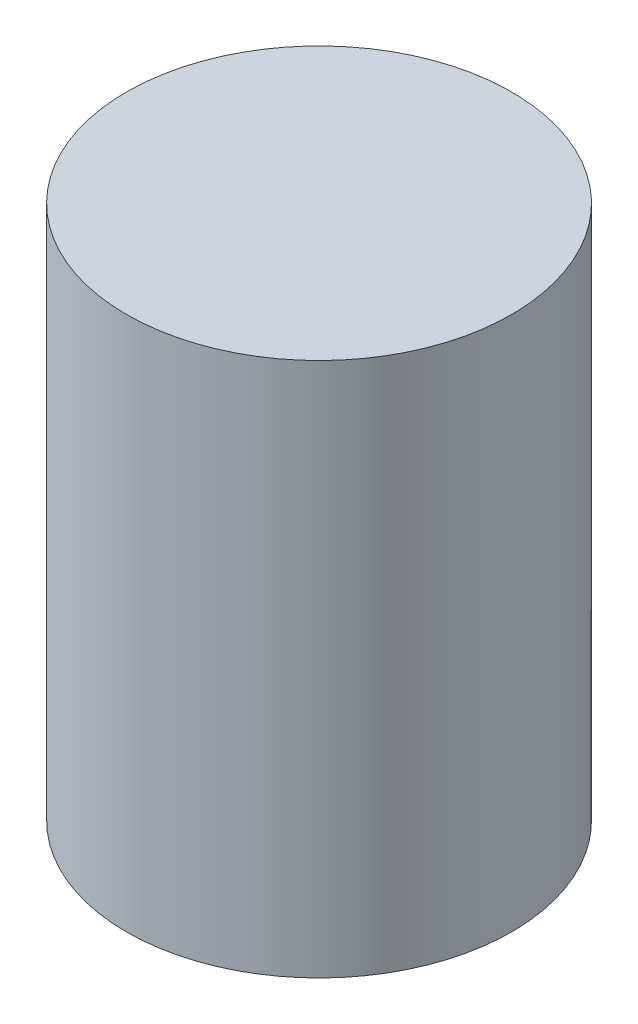
ISO-10303-21;
HEADER;
FILE_DESCRIPTION(('STEP AP214'),'2;1');
FILE_NAME('part.step','',(''),(''),'','','');
FILE_SCHEMA(('AUTOMOTIVE_DESIGN { 1 0 10303 214 1 1 1 1 }'));
ENDSEC;
DATA;
#1=APPLICATION_CONTEXT('core data for automotive mechanical design processes');
#2=APPLICATION_PROTOCOL_DEFINITION('international standard','automotive_design',2000,#1);
#3=PRODUCT_CONTEXT('',#1,'mechanical');
#4=PRODUCT('Part','Part','',(#3));
#5=PRODUCT_RELATED_PRODUCT_CATEGORY('part','',(#4));
#6=PRODUCT_DEFINITION_FORMATION('','',#4);
#7=PRODUCT_DEFINITION_CONTEXT('part definition',#1,'design');
#8=PRODUCT_DEFINITION('design','',#6,#7);
#9=PRODUCT_DEFINITION_SHAPE('','',#8);
#10=(LENGTH_UNIT() NAMED_UNIT(*) SI_UNIT(.MILLI.,.METRE.));
#11=(NAMED_UNIT(*) PLANE_ANGLE_UNIT() SI_UNIT($,.RADIAN.));
#12=(NAMED_UNIT(*) SI_UNIT($,.STERADIAN.) SOLID_ANGLE_UNIT());
#13=UNCERTAINTY_MEASURE_WITH_UNIT(LENGTH_MEASURE(1.E-05),#10,'distance_accuracy_value','');
#14=(GEOMETRIC_REPRESENTATION_CONTEXT(3) GLOBAL_UNCERTAINTY_ASSIGNED_CONTEXT((#13)) GLOBAL_UNIT_ASSIGNED_CONTEXT((#10,
#11,#12)) REPRESENTATION_CONTEXT('',''));
#15=CARTESIAN_POINT('',(0.,0.,0.));
#16=DIRECTION('',(0.,0.,1.));
#17=DIRECTION('',(1.,0.,0.));
#18=AXIS2_PLACEMENT_3D('',#15,#16,#17);
#19=CARTESIAN_POINT('',(0.,13.49375,0.));
#20=DIRECTION('',(0.,-1.,0.));
#21=DIRECTION('',(0.,0.,-1.));
#22=AXIS2_PLACEMENT_3D('',#19,#20,#21);
#23=CYLINDRICAL_SURFACE('',#22,9.723);
#24=CARTESIAN_POINT('',(0.,13.49375,0.));
#25=DIRECTION('',(0.,1.,0.));
#26=DIRECTION('',(0.,0.,1.));
#27=AXIS2_PLACEMENT_3D('',#24,#25,#26);
#28=CIRCLE('',#27,9.723);
#29=CARTESIAN_POINT('',(0.,13.49375,9.723));
#30=VERTEX_POINT('',#29);
#31=EDGE_CURVE('E10',#30,#30,#28,.T.);
#32=ORIENTED_EDGE('',*,*,#31,.F.);
#33=EDGE_LOOP('',(#32));
#34=FACE_BOUND('',#33,.T.);
#35=CARTESIAN_POINT('',(0.,-13.49375,0.));
#36=DIRECTION('',(0.,1.,0.));
#37=DIRECTION('',(0.,0.,1.));
#38=AXIS2_PLACEMENT_3D('',#35,#36,#37);
#39=CIRCLE('',#38,9.723);
#40=CARTESIAN_POINT('',(0.,-13.49375,9.723));
#41=VERTEX_POINT('',#40);
#42=EDGE_CURVE('E40',#41,#41,#39,.T.);
#43=ORIENTED_EDGE('',*,*,#42,.T.);
#44=EDGE_LOOP('',(#43));
#45=FACE_BOUND('',#44,.T.);
#46=ADVANCED_FACE('F37',(#34,#45),#23,.T.);
#47=CARTESIAN_POINT('',(0.,13.49375,0.));
#48=DIRECTION('',(0.,1.,0.));
#49=DIRECTION('',(0.,0.,1.));
#50=AXIS2_PLACEMENT_3D('',#47,#48,#49);
#51=PLANE('',#50);
#52=ORIENTED_EDGE('',*,*,#31,.T.);
#53=EDGE_LOOP('',(#52));
#54=FACE_BOUND('',#53,.T.);
#55=ADVANCED_FACE('F54',(#54),#51,.T.);
#56=CARTESIAN_POINT('',(0.,-13.49375,0.));
#57=DIRECTION('',(0.,1.,0.));
#58=DIRECTION('',(0.,0.,1.));
#59=AXIS2_PLACEMENT_3D('',#56,#57,#58);
#60=PLANE('',#59);
#61=ORIENTED_EDGE('',*,*,#42,.F.);
#62=EDGE_LOOP('',(#61));
#63=FACE_BOUND('',#62,.T.);
#64=ADVANCED_FACE('F52',(#63),#60,.F.);
#65=CLOSED_SHELL('',(#46,#55,#64));
#66=MANIFOLD_SOLID_BREP('B2',#65);
#67=ADVANCED_BREP_SHAPE_REPRESENTATION('',(#18,#66),#14);
#68=SHAPE_DEFINITION_REPRESENTATION(#9,#67);
ENDSEC;
END-ISO-10303-21;
